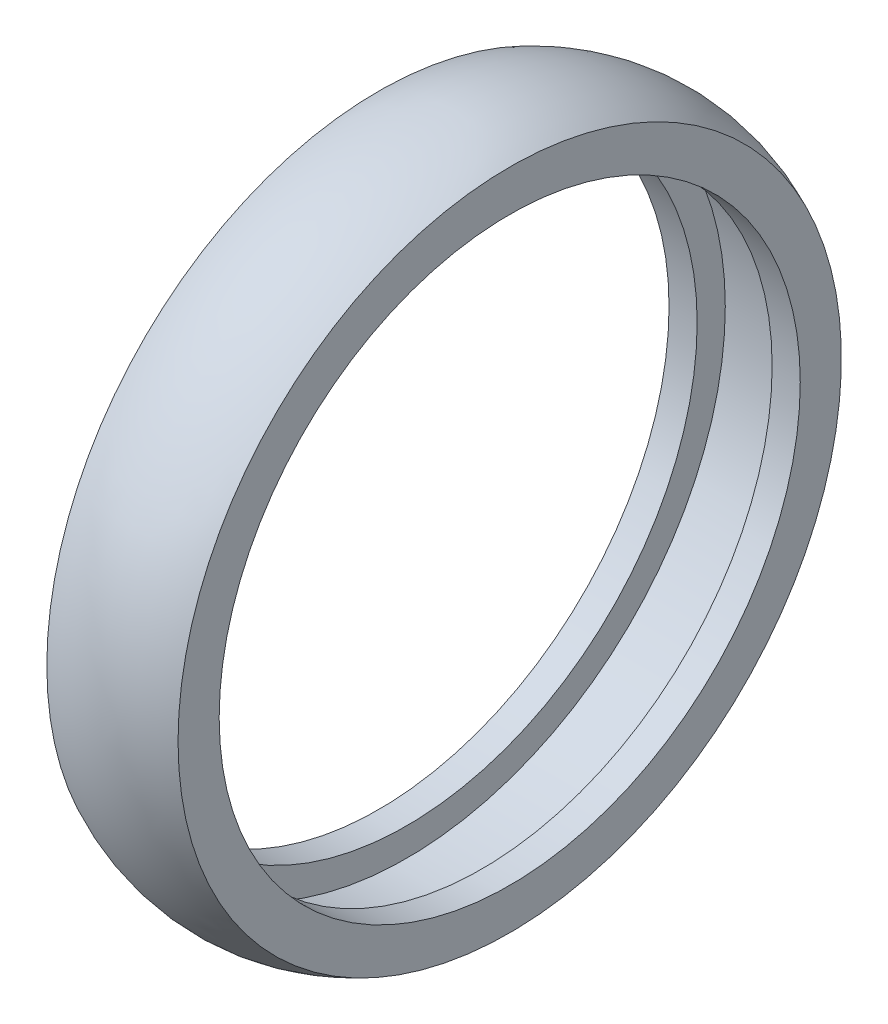
ISO-10303-21;
HEADER;
FILE_DESCRIPTION(('STEP AP214'),'2;1');
FILE_NAME('part.step','',(''),(''),'','','');
FILE_SCHEMA(('AUTOMOTIVE_DESIGN { 1 0 10303 214 1 1 1 1 }'));
ENDSEC;
DATA;
#1=APPLICATION_CONTEXT('core data for automotive mechanical design processes');
#2=APPLICATION_PROTOCOL_DEFINITION('international standard','automotive_design',2000,#1);
#3=PRODUCT_CONTEXT('',#1,'mechanical');
#4=PRODUCT('Part','Part','',(#3));
#5=PRODUCT_RELATED_PRODUCT_CATEGORY('part','',(#4));
#6=PRODUCT_DEFINITION_FORMATION('','',#4);
#7=PRODUCT_DEFINITION_CONTEXT('part definition',#1,'design');
#8=PRODUCT_DEFINITION('design','',#6,#7);
#9=PRODUCT_DEFINITION_SHAPE('','',#8);
#10=(LENGTH_UNIT() NAMED_UNIT(*) SI_UNIT(.MILLI.,.METRE.));
#11=(NAMED_UNIT(*) PLANE_ANGLE_UNIT() SI_UNIT($,.RADIAN.));
#12=(NAMED_UNIT(*) SI_UNIT($,.STERADIAN.) SOLID_ANGLE_UNIT());
#13=UNCERTAINTY_MEASURE_WITH_UNIT(LENGTH_MEASURE(1.E-05),#10,'distance_accuracy_value','');
#14=(GEOMETRIC_REPRESENTATION_CONTEXT(3) GLOBAL_UNCERTAINTY_ASSIGNED_CONTEXT((#13)) GLOBAL_UNIT_ASSIGNED_CONTEXT((#10,
#11,#12)) REPRESENTATION_CONTEXT('',''));
#15=CARTESIAN_POINT('',(0.,0.,0.));
#16=DIRECTION('',(0.,0.,1.));
#17=DIRECTION('',(1.,0.,0.));
#18=AXIS2_PLACEMENT_3D('',#15,#16,#17);
#19=CARTESIAN_POINT('',(-4.,34.,0.));
#20=DIRECTION('',(-1.,0.,0.));
#21=DIRECTION('',(0.,0.,1.));
#22=AXIS2_PLACEMENT_3D('',#19,#20,#21);
#23=PLANE('',#22);
#24=CARTESIAN_POINT('',(-4.,0.,0.));
#25=DIRECTION('',(-1.,0.,0.));
#26=DIRECTION('',(0.,0.,1.));
#27=AXIS2_PLACEMENT_3D('',#24,#25,#26);
#28=CIRCLE('',#27,34.);
#29=CARTESIAN_POINT('',(-4.,0.,34.));
#30=VERTEX_POINT('',#29);
#31=EDGE_CURVE('E58',#30,#30,#28,.T.);
#32=ORIENTED_EDGE('',*,*,#31,.F.);
#33=EDGE_LOOP('',(#32));
#34=FACE_BOUND('',#33,.T.);
#35=CARTESIAN_POINT('',(-4.,0.,0.));
#36=DIRECTION('',(-1.,0.,0.));
#37=DIRECTION('',(0.,0.,1.));
#38=AXIS2_PLACEMENT_3D('',#35,#36,#37);
#39=CIRCLE('',#38,31.);
#40=CARTESIAN_POINT('',(-4.,0.,31.));
#41=VERTEX_POINT('',#40);
#42=EDGE_CURVE('E10',#41,#41,#39,.T.);
#43=ORIENTED_EDGE('',*,*,#42,.T.);
#44=EDGE_LOOP('',(#43));
#45=FACE_BOUND('',#44,.T.);
#46=ADVANCED_FACE('F30',(#34,#45),#23,.F.);
#47=CARTESIAN_POINT('',(-690.466838323814,0.,0.));
#48=DIRECTION('',(-1.,0.,0.));
#49=DIRECTION('',(0.,0.,1.));
#50=AXIS2_PLACEMENT_3D('',#47,#48,#49);
#51=CYLINDRICAL_SURFACE('',#50,31.);
#52=ORIENTED_EDGE('',*,*,#42,.F.);
#53=EDGE_LOOP('',(#52));
#54=FACE_BOUND('',#53,.T.);
#55=CARTESIAN_POINT('',(-7.00000000000001,0.,0.));
#56=DIRECTION('',(-1.,0.,0.));
#57=DIRECTION('',(0.,0.,1.));
#58=AXIS2_PLACEMENT_3D('',#55,#56,#57);
#59=CIRCLE('',#58,31.);
#60=CARTESIAN_POINT('',(-7.00000000000001,0.,31.));
#61=VERTEX_POINT('',#60);
#62=EDGE_CURVE('E36',#61,#61,#59,.T.);
#63=ORIENTED_EDGE('',*,*,#62,.T.);
#64=EDGE_LOOP('',(#63));
#65=FACE_BOUND('',#64,.T.);
#66=ADVANCED_FACE('F65',(#54,#65),#51,.F.);
#67=CARTESIAN_POINT('',(-7.,31.,0.));
#68=DIRECTION('',(1.,0.,0.));
#69=DIRECTION('',(0.,0.,-1.));
#70=AXIS2_PLACEMENT_3D('',#67,#68,#69);
#71=PLANE('',#70);
#72=ORIENTED_EDGE('',*,*,#62,.F.);
#73=EDGE_LOOP('',(#72));
#74=FACE_BOUND('',#73,.T.);
#75=CARTESIAN_POINT('',(-7.00000000000001,0.,0.));
#76=DIRECTION('',(-1.,0.,0.));
#77=DIRECTION('',(0.,0.,1.));
#78=AXIS2_PLACEMENT_3D('',#75,#76,#77);
#79=CIRCLE('',#78,35.3874945699382);
#80=CARTESIAN_POINT('',(-7.00000000000001,0.,35.3874945699382));
#81=VERTEX_POINT('',#80);
#82=EDGE_CURVE('E40',#81,#81,#79,.T.);
#83=ORIENTED_EDGE('',*,*,#82,.T.);
#84=EDGE_LOOP('',(#83));
#85=FACE_BOUND('',#84,.T.);
#86=ADVANCED_FACE('F69',(#74,#85),#71,.F.);
#87=CARTESIAN_POINT('',(0.,0.,0.));
#88=DIRECTION('',(-1.,0.,0.));
#89=DIRECTION('',(0.,0.,1.));
#90=AXIS2_PLACEMENT_3D('',#87,#88,#89);
#91=TOROIDAL_SURFACE('',#90,21.,16.);
#92=ORIENTED_EDGE('',*,*,#82,.F.);
#93=EDGE_LOOP('',(#92));
#94=FACE_BOUND('',#93,.T.);
#95=CARTESIAN_POINT('',(7.00000000000001,0.,0.));
#96=DIRECTION('',(-1.,0.,0.));
#97=DIRECTION('',(0.,0.,1.));
#98=AXIS2_PLACEMENT_3D('',#95,#96,#97);
#99=CIRCLE('',#98,35.3874945699382);
#100=CARTESIAN_POINT('',(7.00000000000001,0.,35.3874945699382));
#101=VERTEX_POINT('',#100);
#102=EDGE_CURVE('E44',#101,#101,#99,.T.);
#103=ORIENTED_EDGE('',*,*,#102,.T.);
#104=EDGE_LOOP('',(#103));
#105=FACE_BOUND('',#104,.T.);
#106=ADVANCED_FACE('F74',(#94,#105),#91,.T.);
#107=CARTESIAN_POINT('',(7.,31.,0.));
#108=DIRECTION('',(-1.,0.,0.));
#109=DIRECTION('',(0.,0.,1.));
#110=AXIS2_PLACEMENT_3D('',#107,#108,#109);
#111=PLANE('',#110);
#112=ORIENTED_EDGE('',*,*,#102,.F.);
#113=EDGE_LOOP('',(#112));
#114=FACE_BOUND('',#113,.T.);
#115=CARTESIAN_POINT('',(7.00000000000001,0.,0.));
#116=DIRECTION('',(-1.,0.,0.));
#117=DIRECTION('',(0.,0.,1.));
#118=AXIS2_PLACEMENT_3D('',#115,#116,#117);
#119=CIRCLE('',#118,31.);
#120=CARTESIAN_POINT('',(7.00000000000001,0.,31.));
#121=VERTEX_POINT('',#120);
#122=EDGE_CURVE('E49',#121,#121,#119,.T.);
#123=ORIENTED_EDGE('',*,*,#122,.T.);
#124=EDGE_LOOP('',(#123));
#125=FACE_BOUND('',#124,.T.);
#126=ADVANCED_FACE('F80',(#114,#125),#111,.F.);
#127=CARTESIAN_POINT('',(-690.466838323814,0.,0.));
#128=DIRECTION('',(-1.,0.,0.));
#129=DIRECTION('',(0.,0.,1.));
#130=AXIS2_PLACEMENT_3D('',#127,#128,#129);
#131=CYLINDRICAL_SURFACE('',#130,31.);
#132=ORIENTED_EDGE('',*,*,#122,.F.);
#133=EDGE_LOOP('',(#132));
#134=FACE_BOUND('',#133,.T.);
#135=CARTESIAN_POINT('',(4.,0.,0.));
#136=DIRECTION('',(-1.,0.,0.));
#137=DIRECTION('',(0.,0.,1.));
#138=AXIS2_PLACEMENT_3D('',#135,#136,#137);
#139=CIRCLE('',#138,31.);
#140=CARTESIAN_POINT('',(4.,0.,31.));
#141=VERTEX_POINT('',#140);
#142=EDGE_CURVE('E52',#141,#141,#139,.T.);
#143=ORIENTED_EDGE('',*,*,#142,.T.);
#144=EDGE_LOOP('',(#143));
#145=FACE_BOUND('',#144,.T.);
#146=ADVANCED_FACE('F84',(#134,#145),#131,.F.);
#147=CARTESIAN_POINT('',(4.,34.,0.));
#148=DIRECTION('',(1.,0.,0.));
#149=DIRECTION('',(0.,0.,-1.));
#150=AXIS2_PLACEMENT_3D('',#147,#148,#149);
#151=PLANE('',#150);
#152=ORIENTED_EDGE('',*,*,#142,.F.);
#153=EDGE_LOOP('',(#152));
#154=FACE_BOUND('',#153,.T.);
#155=CARTESIAN_POINT('',(4.,0.,0.));
#156=DIRECTION('',(-1.,0.,0.));
#157=DIRECTION('',(0.,0.,1.));
#158=AXIS2_PLACEMENT_3D('',#155,#156,#157);
#159=CIRCLE('',#158,34.);
#160=CARTESIAN_POINT('',(4.,0.,34.));
#161=VERTEX_POINT('',#160);
#162=EDGE_CURVE('E55',#161,#161,#159,.T.);
#163=ORIENTED_EDGE('',*,*,#162,.T.);
#164=EDGE_LOOP('',(#163));
#165=FACE_BOUND('',#164,.T.);
#166=ADVANCED_FACE('F88',(#154,#165),#151,.F.);
#167=CARTESIAN_POINT('',(-690.466838323814,0.,0.));
#168=DIRECTION('',(-1.,0.,0.));
#169=DIRECTION('',(0.,0.,1.));
#170=AXIS2_PLACEMENT_3D('',#167,#168,#169);
#171=CYLINDRICAL_SURFACE('',#170,34.);
#172=ORIENTED_EDGE('',*,*,#162,.F.);
#173=EDGE_LOOP('',(#172));
#174=FACE_BOUND('',#173,.T.);
#175=ORIENTED_EDGE('',*,*,#31,.T.);
#176=EDGE_LOOP('',(#175));
#177=FACE_BOUND('',#176,.T.);
#178=ADVANCED_FACE('F62',(#174,#177),#171,.F.);
#179=CLOSED_SHELL('',(#46,#66,#86,#106,#126,#146,#166,#178));
#180=MANIFOLD_SOLID_BREP('B2',#179);
#181=ADVANCED_BREP_SHAPE_REPRESENTATION('',(#18,#180),#14);
#182=SHAPE_DEFINITION_REPRESENTATION(#9,#181);
ENDSEC;
END-ISO-10303-21;
